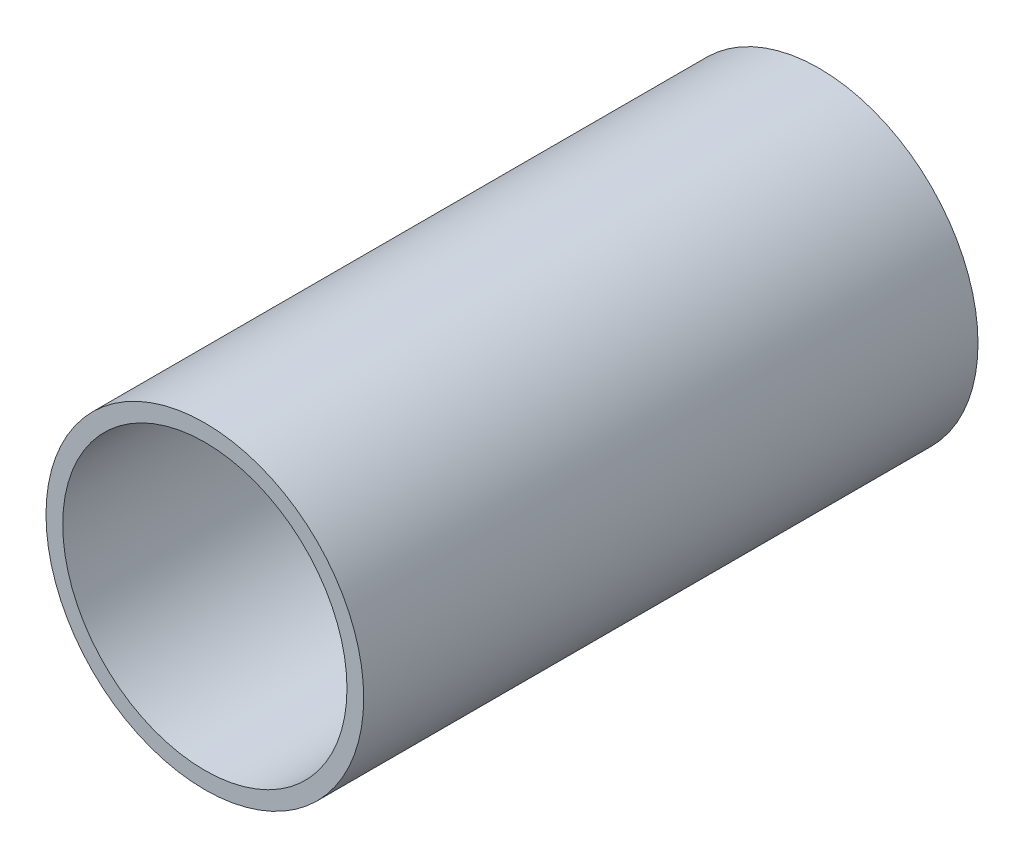
ISO-10303-21;
HEADER;
FILE_DESCRIPTION(('STEP AP214'),'2;1');
FILE_NAME('part.step','',(''),(''),'','','');
FILE_SCHEMA(('AUTOMOTIVE_DESIGN { 1 0 10303 214 1 1 1 1 }'));
ENDSEC;
DATA;
#1=APPLICATION_CONTEXT('core data for automotive mechanical design processes');
#2=APPLICATION_PROTOCOL_DEFINITION('international standard','automotive_design',2000,#1);
#3=PRODUCT_CONTEXT('',#1,'mechanical');
#4=PRODUCT('Part','Part','',(#3));
#5=PRODUCT_RELATED_PRODUCT_CATEGORY('part','',(#4));
#6=PRODUCT_DEFINITION_FORMATION('','',#4);
#7=PRODUCT_DEFINITION_CONTEXT('part definition',#1,'design');
#8=PRODUCT_DEFINITION('design','',#6,#7);
#9=PRODUCT_DEFINITION_SHAPE('','',#8);
#10=(LENGTH_UNIT() NAMED_UNIT(*) SI_UNIT(.MILLI.,.METRE.));
#11=(NAMED_UNIT(*) PLANE_ANGLE_UNIT() SI_UNIT($,.RADIAN.));
#12=(NAMED_UNIT(*) SI_UNIT($,.STERADIAN.) SOLID_ANGLE_UNIT());
#13=UNCERTAINTY_MEASURE_WITH_UNIT(LENGTH_MEASURE(1.E-05),#10,'distance_accuracy_value','');
#14=(GEOMETRIC_REPRESENTATION_CONTEXT(3) GLOBAL_UNCERTAINTY_ASSIGNED_CONTEXT((#13)) GLOBAL_UNIT_ASSIGNED_CONTEXT((#10,
#11,#12)) REPRESENTATION_CONTEXT('',''));
#15=CARTESIAN_POINT('',(0.,0.,0.));
#16=DIRECTION('',(0.,0.,1.));
#17=DIRECTION('',(1.,0.,0.));
#18=AXIS2_PLACEMENT_3D('',#15,#16,#17);
#19=CARTESIAN_POINT('',(0.,0.,110.5));
#20=DIRECTION('',(0.,0.,1.));
#21=DIRECTION('',(1.,0.,0.));
#22=AXIS2_PLACEMENT_3D('',#19,#20,#21);
#23=PLANE('',#22);
#24=CARTESIAN_POINT('',(0.,0.,110.5));
#25=DIRECTION('',(0.,0.,1.));
#26=DIRECTION('',(1.,0.,0.));
#27=AXIS2_PLACEMENT_3D('',#24,#25,#26);
#28=CIRCLE('',#27,57.15);
#29=CARTESIAN_POINT('',(57.15,0.,110.5));
#30=VERTEX_POINT('',#29);
#31=EDGE_CURVE('E11',#30,#30,#28,.T.);
#32=ORIENTED_EDGE('',*,*,#31,.T.);
#33=EDGE_LOOP('',(#32));
#34=FACE_BOUND('',#33,.T.);
#35=CARTESIAN_POINT('',(0.,0.,110.5));
#36=DIRECTION('',(0.,0.,1.));
#37=DIRECTION('',(1.,0.,0.));
#38=AXIS2_PLACEMENT_3D('',#35,#36,#37);
#39=CIRCLE('',#38,51.1302);
#40=CARTESIAN_POINT('',(51.1302,0.,110.5));
#41=VERTEX_POINT('',#40);
#42=EDGE_CURVE('E47',#41,#41,#39,.T.);
#43=ORIENTED_EDGE('',*,*,#42,.F.);
#44=EDGE_LOOP('',(#43));
#45=FACE_BOUND('',#44,.T.);
#46=ADVANCED_FACE('F36',(#34,#45),#23,.T.);
#47=CARTESIAN_POINT('',(0.,0.,-110.5));
#48=DIRECTION('',(0.,0.,1.));
#49=DIRECTION('',(1.,0.,0.));
#50=AXIS2_PLACEMENT_3D('',#47,#48,#49);
#51=PLANE('',#50);
#52=CARTESIAN_POINT('',(0.,0.,-110.5));
#53=DIRECTION('',(0.,0.,1.));
#54=DIRECTION('',(1.,0.,0.));
#55=AXIS2_PLACEMENT_3D('',#52,#53,#54);
#56=CIRCLE('',#55,57.15);
#57=CARTESIAN_POINT('',(57.15,0.,-110.5));
#58=VERTEX_POINT('',#57);
#59=EDGE_CURVE('E40',#58,#58,#56,.T.);
#60=ORIENTED_EDGE('',*,*,#59,.F.);
#61=EDGE_LOOP('',(#60));
#62=FACE_BOUND('',#61,.T.);
#63=CARTESIAN_POINT('',(0.,0.,-110.5));
#64=DIRECTION('',(0.,0.,1.));
#65=DIRECTION('',(1.,0.,0.));
#66=AXIS2_PLACEMENT_3D('',#63,#64,#65);
#67=CIRCLE('',#66,51.1302);
#68=CARTESIAN_POINT('',(51.1302,0.,-110.5));
#69=VERTEX_POINT('',#68);
#70=EDGE_CURVE('E49',#69,#69,#67,.T.);
#71=ORIENTED_EDGE('',*,*,#70,.T.);
#72=EDGE_LOOP('',(#71));
#73=FACE_BOUND('',#72,.T.);
#74=ADVANCED_FACE('F59',(#62,#73),#51,.F.);
#75=CARTESIAN_POINT('',(0.,0.,110.5));
#76=DIRECTION('',(0.,0.,-1.));
#77=DIRECTION('',(-1.,0.,0.));
#78=AXIS2_PLACEMENT_3D('',#75,#76,#77);
#79=CYLINDRICAL_SURFACE('',#78,57.15);
#80=ORIENTED_EDGE('',*,*,#31,.F.);
#81=EDGE_LOOP('',(#80));
#82=FACE_BOUND('',#81,.T.);
#83=ORIENTED_EDGE('',*,*,#59,.T.);
#84=EDGE_LOOP('',(#83));
#85=FACE_BOUND('',#84,.T.);
#86=ADVANCED_FACE('F38',(#82,#85),#79,.T.);
#87=CARTESIAN_POINT('',(0.,0.,110.5));
#88=DIRECTION('',(0.,0.,-1.));
#89=DIRECTION('',(-1.,0.,0.));
#90=AXIS2_PLACEMENT_3D('',#87,#88,#89);
#91=CYLINDRICAL_SURFACE('',#90,51.1302);
#92=ORIENTED_EDGE('',*,*,#42,.T.);
#93=EDGE_LOOP('',(#92));
#94=FACE_BOUND('',#93,.T.);
#95=ORIENTED_EDGE('',*,*,#70,.F.);
#96=EDGE_LOOP('',(#95));
#97=FACE_BOUND('',#96,.T.);
#98=ADVANCED_FACE('F55',(#94,#97),#91,.F.);
#99=CLOSED_SHELL('',(#46,#74,#86,#98));
#100=MANIFOLD_SOLID_BREP('B2',#99);
#101=ADVANCED_BREP_SHAPE_REPRESENTATION('',(#18,#100),#14);
#102=SHAPE_DEFINITION_REPRESENTATION(#9,#101);
ENDSEC;
END-ISO-10303-21;
